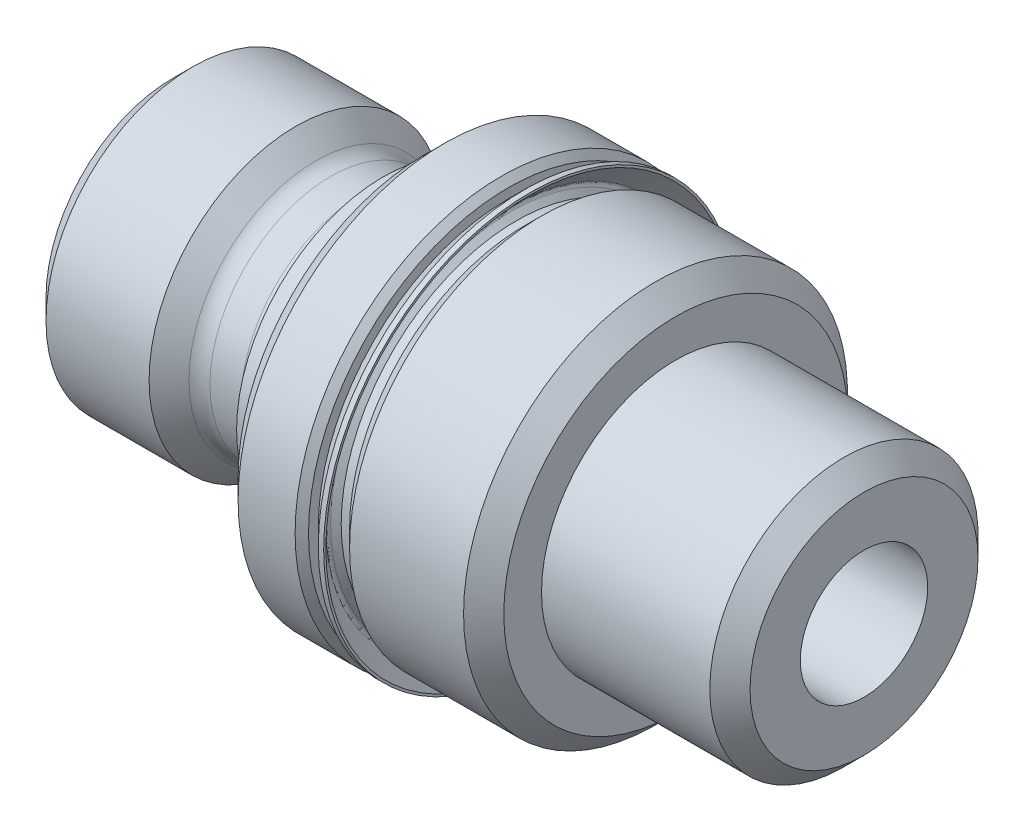
ISO-10303-21;
HEADER;
FILE_DESCRIPTION(('STEP AP214'),'2;1');
FILE_NAME('part.step','',(''),(''),'','','');
FILE_SCHEMA(('AUTOMOTIVE_DESIGN { 1 0 10303 214 1 1 1 1 }'));
ENDSEC;
DATA;
#1=APPLICATION_CONTEXT('core data for automotive mechanical design processes');
#2=APPLICATION_PROTOCOL_DEFINITION('international standard','automotive_design',2000,#1);
#3=PRODUCT_CONTEXT('',#1,'mechanical');
#4=PRODUCT('Part','Part','',(#3));
#5=PRODUCT_RELATED_PRODUCT_CATEGORY('part','',(#4));
#6=PRODUCT_DEFINITION_FORMATION('','',#4);
#7=PRODUCT_DEFINITION_CONTEXT('part definition',#1,'design');
#8=PRODUCT_DEFINITION('design','',#6,#7);
#9=PRODUCT_DEFINITION_SHAPE('','',#8);
#10=(LENGTH_UNIT() NAMED_UNIT(*) SI_UNIT(.MILLI.,.METRE.));
#11=(NAMED_UNIT(*) PLANE_ANGLE_UNIT() SI_UNIT($,.RADIAN.));
#12=(NAMED_UNIT(*) SI_UNIT($,.STERADIAN.) SOLID_ANGLE_UNIT());
#13=UNCERTAINTY_MEASURE_WITH_UNIT(LENGTH_MEASURE(1.E-05),#10,'distance_accuracy_value','');
#14=(GEOMETRIC_REPRESENTATION_CONTEXT(3) GLOBAL_UNCERTAINTY_ASSIGNED_CONTEXT((#13)) GLOBAL_UNIT_ASSIGNED_CONTEXT((#10,
#11,#12)) REPRESENTATION_CONTEXT('',''));
#15=CARTESIAN_POINT('',(0.,0.,0.));
#16=DIRECTION('',(0.,0.,1.));
#17=DIRECTION('',(1.,0.,0.));
#18=AXIS2_PLACEMENT_3D('',#15,#16,#17);
#19=CARTESIAN_POINT('',(12.7,7.5565,0.));
#20=DIRECTION('',(-1.,0.,0.));
#21=DIRECTION('',(0.,0.,1.));
#22=AXIS2_PLACEMENT_3D('',#19,#20,#21);
#23=PLANE('',#22);
#24=CARTESIAN_POINT('',(12.7,0.,0.));
#25=DIRECTION('',(-1.,0.,0.));
#26=DIRECTION('',(0.,0.,1.));
#27=AXIS2_PLACEMENT_3D('',#24,#25,#26);
#28=CIRCLE('',#27,7.5565);
#29=CARTESIAN_POINT('',(12.7,0.,7.5565));
#30=VERTEX_POINT('',#29);
#31=EDGE_CURVE('E87',#30,#30,#28,.T.);
#32=ORIENTED_EDGE('',*,*,#31,.F.);
#33=EDGE_LOOP('',(#32));
#34=FACE_BOUND('',#33,.T.);
#35=CARTESIAN_POINT('',(12.7,0.,0.));
#36=DIRECTION('',(-1.,0.,0.));
#37=DIRECTION('',(0.,0.,1.));
#38=AXIS2_PLACEMENT_3D('',#35,#36,#37);
#39=CIRCLE('',#38,7.1861438079811);
#40=CARTESIAN_POINT('',(12.7,0.,7.1861438079811));
#41=VERTEX_POINT('',#40);
#42=EDGE_CURVE('E10',#41,#41,#39,.F.);
#43=ORIENTED_EDGE('',*,*,#42,.F.);
#44=EDGE_LOOP('',(#43));
#45=FACE_BOUND('',#44,.T.);
#46=ADVANCED_FACE('F34',(#34,#45),#23,.F.);
#47=CARTESIAN_POINT('',(19.05,0.,0.));
#48=DIRECTION('',(-1.,0.,0.));
#49=DIRECTION('',(0.,0.,1.));
#50=AXIS2_PLACEMENT_3D('',#47,#48,#49);
#51=CYLINDRICAL_SURFACE('',#50,6.63575);
#52=CARTESIAN_POINT('',(13.335,0.,0.));
#53=DIRECTION('',(-1.,0.,0.));
#54=DIRECTION('',(0.,0.,1.));
#55=AXIS2_PLACEMENT_3D('',#52,#53,#54);
#56=CIRCLE('',#55,6.63575);
#57=CARTESIAN_POINT('',(13.335,0.,6.63575));
#58=VERTEX_POINT('',#57);
#59=EDGE_CURVE('E90',#58,#58,#56,.T.);
#60=ORIENTED_EDGE('',*,*,#59,.T.);
#61=EDGE_LOOP('',(#60));
#62=FACE_BOUND('',#61,.T.);
#63=CARTESIAN_POINT('',(13.0175,0.,0.));
#64=DIRECTION('',(-1.,0.,0.));
#65=DIRECTION('',(0.,0.,1.));
#66=AXIS2_PLACEMENT_3D('',#63,#64,#65);
#67=CIRCLE('',#66,6.63575);
#68=CARTESIAN_POINT('',(13.0175,0.,6.63575));
#69=VERTEX_POINT('',#68);
#70=EDGE_CURVE('E41',#69,#69,#67,.T.);
#71=ORIENTED_EDGE('',*,*,#70,.F.);
#72=EDGE_LOOP('',(#71));
#73=FACE_BOUND('',#72,.T.);
#74=ADVANCED_FACE('F145',(#62,#73),#51,.T.);
#75=CARTESIAN_POINT('',(19.05,6.50875,0.));
#76=DIRECTION('',(-1.,0.,0.));
#77=DIRECTION('',(0.,0.,1.));
#78=AXIS2_PLACEMENT_3D('',#75,#76,#77);
#79=PLANE('',#78);
#80=CARTESIAN_POINT('',(19.05,0.,0.));
#81=DIRECTION('',(-1.,0.,0.));
#82=DIRECTION('',(0.,0.,1.));
#83=AXIS2_PLACEMENT_3D('',#80,#81,#82);
#84=CIRCLE('',#83,6.50875);
#85=CARTESIAN_POINT('',(19.05,0.,6.50875));
#86=VERTEX_POINT('',#85);
#87=EDGE_CURVE('E99',#86,#86,#84,.T.);
#88=ORIENTED_EDGE('',*,*,#87,.F.);
#89=EDGE_LOOP('',(#88));
#90=FACE_BOUND('',#89,.T.);
#91=CARTESIAN_POINT('',(19.05,0.,0.));
#92=DIRECTION('',(-1.,0.,0.));
#93=DIRECTION('',(0.,0.,1.));
#94=AXIS2_PLACEMENT_3D('',#91,#92,#93);
#95=CIRCLE('',#94,5.08);
#96=CARTESIAN_POINT('',(19.05,0.,5.08));
#97=VERTEX_POINT('',#96);
#98=EDGE_CURVE('E45',#97,#97,#95,.F.);
#99=ORIENTED_EDGE('',*,*,#98,.F.);
#100=EDGE_LOOP('',(#99));
#101=FACE_BOUND('',#100,.T.);
#102=ADVANCED_FACE('F151',(#90,#101),#79,.F.);
#103=CARTESIAN_POINT('',(9.525,0.,0.));
#104=DIRECTION('',(-1.,0.,0.));
#105=DIRECTION('',(0.,0.,1.));
#106=AXIS2_PLACEMENT_3D('',#103,#104,#105);
#107=CYLINDRICAL_SURFACE('',#106,5.53085);
#108=CARTESIAN_POINT('',(7.9502,0.,0.));
#109=DIRECTION('',(-1.,0.,0.));
#110=DIRECTION('',(0.,0.,1.));
#111=AXIS2_PLACEMENT_3D('',#108,#109,#110);
#112=CIRCLE('',#111,5.53085);
#113=CARTESIAN_POINT('',(7.9502,0.,5.53085));
#114=VERTEX_POINT('',#113);
#115=EDGE_CURVE('E49',#114,#114,#112,.T.);
#116=ORIENTED_EDGE('',*,*,#115,.F.);
#117=EDGE_LOOP('',(#116));
#118=FACE_BOUND('',#117,.T.);
#119=CARTESIAN_POINT('',(9.525,0.,0.));
#120=DIRECTION('',(1.,0.,0.));
#121=DIRECTION('',(0.,0.,-1.));
#122=AXIS2_PLACEMENT_3D('',#119,#120,#121);
#123=CIRCLE('',#122,5.53085);
#124=CARTESIAN_POINT('',(9.525,0.,-5.53085));
#125=VERTEX_POINT('',#124);
#126=EDGE_CURVE('E75',#125,#125,#123,.T.);
#127=ORIENTED_EDGE('',*,*,#126,.F.);
#128=EDGE_LOOP('',(#127));
#129=FACE_BOUND('',#128,.T.);
#130=ADVANCED_FACE('F36',(#118,#129),#107,.T.);
#131=CARTESIAN_POINT('',(7.9502,5.37209999999985,0.));
#132=DIRECTION('',(1.,0.,0.));
#133=DIRECTION('',(0.,0.,-1.));
#134=AXIS2_PLACEMENT_3D('',#131,#132,#133);
#135=PLANE('',#134);
#136=CARTESIAN_POINT('',(7.9502,0.,0.));
#137=DIRECTION('',(-1.,0.,0.));
#138=DIRECTION('',(0.,0.,1.));
#139=AXIS2_PLACEMENT_3D('',#136,#137,#138);
#140=CIRCLE('',#139,5.37209999999985);
#141=CARTESIAN_POINT('',(7.9502,0.,5.37209999999985));
#142=VERTEX_POINT('',#141);
#143=EDGE_CURVE('E54',#142,#142,#140,.T.);
#144=ORIENTED_EDGE('',*,*,#143,.F.);
#145=EDGE_LOOP('',(#144));
#146=FACE_BOUND('',#145,.T.);
#147=ORIENTED_EDGE('',*,*,#115,.T.);
#148=EDGE_LOOP('',(#147));
#149=FACE_BOUND('',#148,.T.);
#150=ADVANCED_FACE('F201',(#146,#149),#135,.F.);
#151=CARTESIAN_POINT('',(7.15010000000015,0.,0.));
#152=DIRECTION('',(-1.,0.,0.));
#153=DIRECTION('',(0.,0.,1.));
#154=AXIS2_PLACEMENT_3D('',#151,#152,#153);
#155=TOROIDAL_SURFACE('',#154,5.37209999999985,0.800099999999851);
#156=CARTESIAN_POINT('',(7.15010000000015,0.,0.));
#157=DIRECTION('',(-1.,0.,0.));
#158=DIRECTION('',(0.,0.,1.));
#159=AXIS2_PLACEMENT_3D('',#156,#157,#158);
#160=CIRCLE('',#159,4.572);
#161=CARTESIAN_POINT('',(7.15010000000015,0.,4.572));
#162=VERTEX_POINT('',#161);
#163=EDGE_CURVE('E57',#162,#162,#160,.T.);
#164=ORIENTED_EDGE('',*,*,#163,.F.);
#165=EDGE_LOOP('',(#164));
#166=FACE_BOUND('',#165,.T.);
#167=ORIENTED_EDGE('',*,*,#143,.T.);
#168=EDGE_LOOP('',(#167));
#169=FACE_BOUND('',#168,.T.);
#170=ADVANCED_FACE('F198',(#166,#169),#155,.F.);
#171=CARTESIAN_POINT('',(9.525,0.,0.));
#172=DIRECTION('',(-1.,0.,0.));
#173=DIRECTION('',(0.,0.,1.));
#174=AXIS2_PLACEMENT_3D('',#171,#172,#173);
#175=CYLINDRICAL_SURFACE('',#174,4.572);
#176=CARTESIAN_POINT('',(5.9817,0.,0.));
#177=DIRECTION('',(-1.,0.,0.));
#178=DIRECTION('',(0.,0.,1.));
#179=AXIS2_PLACEMENT_3D('',#176,#177,#178);
#180=CIRCLE('',#179,4.572);
#181=CARTESIAN_POINT('',(5.9817,0.,4.572));
#182=VERTEX_POINT('',#181);
#183=EDGE_CURVE('E60',#182,#182,#180,.T.);
#184=ORIENTED_EDGE('',*,*,#183,.F.);
#185=EDGE_LOOP('',(#184));
#186=FACE_BOUND('',#185,.T.);
#187=ORIENTED_EDGE('',*,*,#163,.T.);
#188=EDGE_LOOP('',(#187));
#189=FACE_BOUND('',#188,.T.);
#190=ADVANCED_FACE('F194',(#186,#189),#175,.T.);
#191=CARTESIAN_POINT('',(5.98170000000007,0.,0.));
#192=DIRECTION('',(-1.,0.,0.));
#193=DIRECTION('',(0.,0.,1.));
#194=AXIS2_PLACEMENT_3D('',#191,#192,#193);
#195=TOROIDAL_SURFACE('',#194,5.37210000000021,0.800100000000214);
#196=CARTESIAN_POINT('',(5.41810329137171,0.,0.));
#197=DIRECTION('',(-1.,0.,0.));
#198=DIRECTION('',(0.,0.,1.));
#199=AXIS2_PLACEMENT_3D('',#196,#197,#198);
#200=CIRCLE('',#199,4.80419264838059);
#201=CARTESIAN_POINT('',(5.41810329137171,0.,4.80419264838059));
#202=VERTEX_POINT('',#201);
#203=EDGE_CURVE('E63',#202,#202,#200,.T.);
#204=ORIENTED_EDGE('',*,*,#203,.F.);
#205=EDGE_LOOP('',(#204));
#206=FACE_BOUND('',#205,.T.);
#207=ORIENTED_EDGE('',*,*,#183,.T.);
#208=EDGE_LOOP('',(#207));
#209=FACE_BOUND('',#208,.T.);
#210=ADVANCED_FACE('F190',(#206,#209),#195,.F.);
#211=CARTESIAN_POINT('',(5.41810329137171,0.,0.));
#212=DIRECTION('',(-1.,0.,0.));
#213=DIRECTION('',(0.,0.,1.));
#214=AXIS2_PLACEMENT_3D('',#211,#212,#213);
#215=CONICAL_SURFACE('',#214,4.80419264838059,0.781588524273102);
#216=CARTESIAN_POINT('',(4.6602938643726,0.,0.));
#217=DIRECTION('',(-1.,0.,0.));
#218=DIRECTION('',(0.,0.,1.));
#219=AXIS2_PLACEMENT_3D('',#216,#217,#218);
#220=CIRCLE('',#219,5.55625);
#221=CARTESIAN_POINT('',(4.6602938643726,0.,5.55625));
#222=VERTEX_POINT('',#221);
#223=EDGE_CURVE('E66',#222,#222,#220,.T.);
#224=ORIENTED_EDGE('',*,*,#223,.F.);
#225=EDGE_LOOP('',(#224));
#226=FACE_BOUND('',#225,.T.);
#227=ORIENTED_EDGE('',*,*,#203,.T.);
#228=EDGE_LOOP('',(#227));
#229=FACE_BOUND('',#228,.T.);
#230=ADVANCED_FACE('F186',(#226,#229),#215,.T.);
#231=CARTESIAN_POINT('',(9.525,0.,0.));
#232=DIRECTION('',(-1.,0.,0.));
#233=DIRECTION('',(0.,0.,1.));
#234=AXIS2_PLACEMENT_3D('',#231,#232,#233);
#235=CYLINDRICAL_SURFACE('',#234,5.55625);
#236=CARTESIAN_POINT('',(0.75565,0.,0.));
#237=DIRECTION('',(-1.,0.,0.));
#238=DIRECTION('',(0.,0.,1.));
#239=AXIS2_PLACEMENT_3D('',#236,#237,#238);
#240=CIRCLE('',#239,5.55625);
#241=CARTESIAN_POINT('',(0.75565,0.,5.55625));
#242=VERTEX_POINT('',#241);
#243=EDGE_CURVE('E69',#242,#242,#240,.T.);
#244=ORIENTED_EDGE('',*,*,#243,.F.);
#245=EDGE_LOOP('',(#244));
#246=FACE_BOUND('',#245,.T.);
#247=ORIENTED_EDGE('',*,*,#223,.T.);
#248=EDGE_LOOP('',(#247));
#249=FACE_BOUND('',#248,.T.);
#250=ADVANCED_FACE('F182',(#246,#249),#235,.T.);
#251=CARTESIAN_POINT('',(0.75565,0.,0.));
#252=DIRECTION('',(1.,0.,0.));
#253=DIRECTION('',(0.,0.,-1.));
#254=AXIS2_PLACEMENT_3D('',#251,#252,#253);
#255=CONICAL_SURFACE('',#254,5.55625,0.785398163397448);
#256=CARTESIAN_POINT('',(0.,0.,0.));
#257=DIRECTION('',(-1.,0.,0.));
#258=DIRECTION('',(0.,0.,1.));
#259=AXIS2_PLACEMENT_3D('',#256,#257,#258);
#260=CIRCLE('',#259,4.8006);
#261=CARTESIAN_POINT('',(0.,0.,4.8006));
#262=VERTEX_POINT('',#261);
#263=EDGE_CURVE('E72',#262,#262,#260,.T.);
#264=ORIENTED_EDGE('',*,*,#263,.F.);
#265=EDGE_LOOP('',(#264));
#266=FACE_BOUND('',#265,.T.);
#267=ORIENTED_EDGE('',*,*,#243,.T.);
#268=EDGE_LOOP('',(#267));
#269=FACE_BOUND('',#268,.T.);
#270=ADVANCED_FACE('F178',(#266,#269),#255,.T.);
#271=CARTESIAN_POINT('',(0.,0.,0.));
#272=DIRECTION('',(1.,0.,0.));
#273=DIRECTION('',(0.,0.,-1.));
#274=AXIS2_PLACEMENT_3D('',#271,#272,#273);
#275=PLANE('',#274);
#276=CARTESIAN_POINT('',(0.,0.,0.));
#277=DIRECTION('',(-1.,0.,0.));
#278=DIRECTION('',(0.,0.,1.));
#279=AXIS2_PLACEMENT_3D('',#276,#277,#278);
#280=CIRCLE('',#279,2.921);
#281=CARTESIAN_POINT('',(0.,0.,2.921));
#282=VERTEX_POINT('',#281);
#283=EDGE_CURVE('E114',#282,#282,#280,.T.);
#284=ORIENTED_EDGE('',*,*,#283,.F.);
#285=EDGE_LOOP('',(#284));
#286=FACE_BOUND('',#285,.T.);
#287=ORIENTED_EDGE('',*,*,#263,.T.);
#288=EDGE_LOOP('',(#287));
#289=FACE_BOUND('',#288,.T.);
#290=ADVANCED_FACE('F174',(#286,#289),#275,.F.);
#291=CARTESIAN_POINT('',(9.525,0.,0.));
#292=DIRECTION('',(1.,0.,0.));
#293=DIRECTION('',(0.,0.,-1.));
#294=AXIS2_PLACEMENT_3D('',#291,#292,#293);
#295=PLANE('',#294);
#296=CARTESIAN_POINT('',(9.525,0.,0.));
#297=DIRECTION('',(-1.,0.,0.));
#298=DIRECTION('',(0.,0.,1.));
#299=AXIS2_PLACEMENT_3D('',#296,#297,#298);
#300=CIRCLE('',#299,7.0485);
#301=CARTESIAN_POINT('',(9.525,0.,7.0485));
#302=VERTEX_POINT('',#301);
#303=EDGE_CURVE('E78',#302,#302,#300,.T.);
#304=ORIENTED_EDGE('',*,*,#303,.T.);
#305=EDGE_LOOP('',(#304));
#306=FACE_BOUND('',#305,.T.);
#307=ORIENTED_EDGE('',*,*,#126,.T.);
#308=EDGE_LOOP('',(#307));
#309=FACE_BOUND('',#308,.T.);
#310=ADVANCED_FACE('F170',(#306,#309),#295,.F.);
#311=CARTESIAN_POINT('',(10.287,0.,0.));
#312=DIRECTION('',(1.,0.,0.));
#313=DIRECTION('',(0.,0.,-1.));
#314=AXIS2_PLACEMENT_3D('',#311,#312,#313);
#315=CONICAL_SURFACE('',#314,7.8105,0.785398163397448);
#316=ORIENTED_EDGE('',*,*,#303,.F.);
#317=EDGE_LOOP('',(#316));
#318=FACE_BOUND('',#317,.T.);
#319=CARTESIAN_POINT('',(10.287,0.,0.));
#320=DIRECTION('',(-1.,0.,0.));
#321=DIRECTION('',(0.,0.,1.));
#322=AXIS2_PLACEMENT_3D('',#319,#320,#321);
#323=CIRCLE('',#322,7.8105);
#324=CARTESIAN_POINT('',(10.287,0.,7.8105));
#325=VERTEX_POINT('',#324);
#326=EDGE_CURVE('E81',#325,#325,#323,.T.);
#327=ORIENTED_EDGE('',*,*,#326,.T.);
#328=EDGE_LOOP('',(#327));
#329=FACE_BOUND('',#328,.T.);
#330=ADVANCED_FACE('F166',(#318,#329),#315,.T.);
#331=CARTESIAN_POINT('',(19.05,0.,0.));
#332=DIRECTION('',(-1.,0.,0.));
#333=DIRECTION('',(0.,0.,1.));
#334=AXIS2_PLACEMENT_3D('',#331,#332,#333);
#335=CYLINDRICAL_SURFACE('',#334,7.8105);
#336=ORIENTED_EDGE('',*,*,#326,.F.);
#337=EDGE_LOOP('',(#336));
#338=FACE_BOUND('',#337,.T.);
#339=CARTESIAN_POINT('',(12.446,0.,0.));
#340=DIRECTION('',(-1.,0.,0.));
#341=DIRECTION('',(0.,0.,1.));
#342=AXIS2_PLACEMENT_3D('',#339,#340,#341);
#343=CIRCLE('',#342,7.8105);
#344=CARTESIAN_POINT('',(12.446,0.,7.8105));
#345=VERTEX_POINT('',#344);
#346=EDGE_CURVE('E84',#345,#345,#343,.T.);
#347=ORIENTED_EDGE('',*,*,#346,.T.);
#348=EDGE_LOOP('',(#347));
#349=FACE_BOUND('',#348,.T.);
#350=ADVANCED_FACE('F162',(#338,#349),#335,.T.);
#351=CARTESIAN_POINT('',(12.7,0.,0.));
#352=DIRECTION('',(-1.,0.,0.));
#353=DIRECTION('',(0.,0.,1.));
#354=AXIS2_PLACEMENT_3D('',#351,#352,#353);
#355=CONICAL_SURFACE('',#354,7.5565,0.785398163397452);
#356=ORIENTED_EDGE('',*,*,#346,.F.);
#357=EDGE_LOOP('',(#356));
#358=FACE_BOUND('',#357,.T.);
#359=ORIENTED_EDGE('',*,*,#31,.T.);
#360=EDGE_LOOP('',(#359));
#361=FACE_BOUND('',#360,.T.);
#362=ADVANCED_FACE('F158',(#358,#361),#355,.T.);
#363=CARTESIAN_POINT('',(13.97,0.,0.));
#364=DIRECTION('',(1.,0.,0.));
#365=DIRECTION('',(0.,0.,-1.));
#366=AXIS2_PLACEMENT_3D('',#363,#364,#365);
#367=CONICAL_SURFACE('',#366,7.27075,0.785398163397448);
#368=ORIENTED_EDGE('',*,*,#59,.F.);
#369=EDGE_LOOP('',(#368));
#370=FACE_BOUND('',#369,.T.);
#371=CARTESIAN_POINT('',(13.97,0.,0.));
#372=DIRECTION('',(-1.,0.,0.));
#373=DIRECTION('',(0.,0.,1.));
#374=AXIS2_PLACEMENT_3D('',#371,#372,#373);
#375=CIRCLE('',#374,7.27075);
#376=CARTESIAN_POINT('',(13.97,0.,7.27075));
#377=VERTEX_POINT('',#376);
#378=EDGE_CURVE('E93',#377,#377,#375,.T.);
#379=ORIENTED_EDGE('',*,*,#378,.T.);
#380=EDGE_LOOP('',(#379));
#381=FACE_BOUND('',#380,.T.);
#382=ADVANCED_FACE('F161',(#370,#381),#367,.T.);
#383=CARTESIAN_POINT('',(19.05,0.,0.));
#384=DIRECTION('',(-1.,0.,0.));
#385=DIRECTION('',(0.,0.,1.));
#386=AXIS2_PLACEMENT_3D('',#383,#384,#385);
#387=CYLINDRICAL_SURFACE('',#386,7.27075);
#388=ORIENTED_EDGE('',*,*,#378,.F.);
#389=EDGE_LOOP('',(#388));
#390=FACE_BOUND('',#389,.T.);
#391=CARTESIAN_POINT('',(18.288,0.,0.));
#392=DIRECTION('',(-1.,0.,0.));
#393=DIRECTION('',(0.,0.,1.));
#394=AXIS2_PLACEMENT_3D('',#391,#392,#393);
#395=CIRCLE('',#394,7.27075);
#396=CARTESIAN_POINT('',(18.288,0.,7.27075));
#397=VERTEX_POINT('',#396);
#398=EDGE_CURVE('E96',#397,#397,#395,.T.);
#399=ORIENTED_EDGE('',*,*,#398,.T.);
#400=EDGE_LOOP('',(#399));
#401=FACE_BOUND('',#400,.T.);
#402=ADVANCED_FACE('F232',(#390,#401),#387,.T.);
#403=CARTESIAN_POINT('',(19.05,0.,0.));
#404=DIRECTION('',(-1.,0.,0.));
#405=DIRECTION('',(0.,0.,1.));
#406=AXIS2_PLACEMENT_3D('',#403,#404,#405);
#407=CONICAL_SURFACE('',#406,6.50875,0.785398163397449);
#408=ORIENTED_EDGE('',*,*,#398,.F.);
#409=EDGE_LOOP('',(#408));
#410=FACE_BOUND('',#409,.T.);
#411=ORIENTED_EDGE('',*,*,#87,.T.);
#412=EDGE_LOOP('',(#411));
#413=FACE_BOUND('',#412,.T.);
#414=ADVANCED_FACE('F229',(#410,#413),#407,.T.);
#415=CARTESIAN_POINT('',(26.1874,0.,0.));
#416=DIRECTION('',(-1.,0.,0.));
#417=DIRECTION('',(0.,0.,1.));
#418=AXIS2_PLACEMENT_3D('',#415,#416,#417);
#419=CYLINDRICAL_SURFACE('',#418,5.08);
#420=ORIENTED_EDGE('',*,*,#98,.T.);
#421=EDGE_LOOP('',(#420));
#422=FACE_BOUND('',#421,.T.);
#423=CARTESIAN_POINT('',(25.4254,0.,0.));
#424=DIRECTION('',(-1.,0.,0.));
#425=DIRECTION('',(0.,0.,1.));
#426=AXIS2_PLACEMENT_3D('',#423,#424,#425);
#427=CIRCLE('',#426,5.08);
#428=CARTESIAN_POINT('',(25.4254,0.,5.08));
#429=VERTEX_POINT('',#428);
#430=EDGE_CURVE('E102',#429,#429,#427,.T.);
#431=ORIENTED_EDGE('',*,*,#430,.T.);
#432=EDGE_LOOP('',(#431));
#433=FACE_BOUND('',#432,.T.);
#434=ADVANCED_FACE('F227',(#422,#433),#419,.T.);
#435=CARTESIAN_POINT('',(26.1874,0.,0.));
#436=DIRECTION('',(-1.,0.,0.));
#437=DIRECTION('',(0.,0.,1.));
#438=AXIS2_PLACEMENT_3D('',#435,#436,#437);
#439=CONICAL_SURFACE('',#438,4.318,0.78539816339745);
#440=ORIENTED_EDGE('',*,*,#430,.F.);
#441=EDGE_LOOP('',(#440));
#442=FACE_BOUND('',#441,.T.);
#443=CARTESIAN_POINT('',(26.1874,0.,0.));
#444=DIRECTION('',(-1.,0.,0.));
#445=DIRECTION('',(0.,0.,1.));
#446=AXIS2_PLACEMENT_3D('',#443,#444,#445);
#447=CIRCLE('',#446,4.318);
#448=CARTESIAN_POINT('',(26.1874,0.,4.318));
#449=VERTEX_POINT('',#448);
#450=EDGE_CURVE('E105',#449,#449,#447,.T.);
#451=ORIENTED_EDGE('',*,*,#450,.T.);
#452=EDGE_LOOP('',(#451));
#453=FACE_BOUND('',#452,.T.);
#454=ADVANCED_FACE('F266',(#442,#453),#439,.T.);
#455=CARTESIAN_POINT('',(26.1874,4.318,0.));
#456=DIRECTION('',(-1.,0.,0.));
#457=DIRECTION('',(0.,0.,1.));
#458=AXIS2_PLACEMENT_3D('',#455,#456,#457);
#459=PLANE('',#458);
#460=CARTESIAN_POINT('',(26.1874,0.,0.));
#461=DIRECTION('',(-1.,0.,0.));
#462=DIRECTION('',(0.,0.,1.));
#463=AXIS2_PLACEMENT_3D('',#460,#461,#462);
#464=CIRCLE('',#463,2.413);
#465=CARTESIAN_POINT('',(26.1874,0.,2.413));
#466=VERTEX_POINT('',#465);
#467=EDGE_CURVE('E108',#466,#466,#464,.T.);
#468=ORIENTED_EDGE('',*,*,#467,.T.);
#469=EDGE_LOOP('',(#468));
#470=FACE_BOUND('',#469,.T.);
#471=ORIENTED_EDGE('',*,*,#450,.F.);
#472=EDGE_LOOP('',(#471));
#473=FACE_BOUND('',#472,.T.);
#474=ADVANCED_FACE('F274',(#470,#473),#459,.F.);
#475=CARTESIAN_POINT('',(0.,0.,0.));
#476=DIRECTION('',(-1.,0.,0.));
#477=DIRECTION('',(0.,0.,1.));
#478=AXIS2_PLACEMENT_3D('',#475,#476,#477);
#479=CYLINDRICAL_SURFACE('',#478,2.413);
#480=ORIENTED_EDGE('',*,*,#467,.F.);
#481=EDGE_LOOP('',(#480));
#482=FACE_BOUND('',#481,.T.);
#483=CARTESIAN_POINT('',(0.507999999999995,0.,0.));
#484=DIRECTION('',(-1.,0.,0.));
#485=DIRECTION('',(0.,0.,1.));
#486=AXIS2_PLACEMENT_3D('',#483,#484,#485);
#487=CIRCLE('',#486,2.413);
#488=CARTESIAN_POINT('',(0.507999999999995,0.,2.413));
#489=VERTEX_POINT('',#488);
#490=EDGE_CURVE('E111',#489,#489,#487,.T.);
#491=ORIENTED_EDGE('',*,*,#490,.T.);
#492=EDGE_LOOP('',(#491));
#493=FACE_BOUND('',#492,.T.);
#494=ADVANCED_FACE('F281',(#482,#493),#479,.F.);
#495=CARTESIAN_POINT('',(0.,0.,0.));
#496=DIRECTION('',(-1.,0.,0.));
#497=DIRECTION('',(0.,0.,1.));
#498=AXIS2_PLACEMENT_3D('',#495,#496,#497);
#499=CONICAL_SURFACE('',#498,2.921,0.785398163397448);
#500=ORIENTED_EDGE('',*,*,#490,.F.);
#501=EDGE_LOOP('',(#500));
#502=FACE_BOUND('',#501,.T.);
#503=ORIENTED_EDGE('',*,*,#283,.T.);
#504=EDGE_LOOP('',(#503));
#505=FACE_BOUND('',#504,.T.);
#506=ADVANCED_FACE('F290',(#502,#505),#499,.F.);
#507=CARTESIAN_POINT('',(13.324356192019,0.,0.));
#508=DIRECTION('',(1.,0.,0.));
#509=DIRECTION('',(0.,0.,-1.));
#510=AXIS2_PLACEMENT_3D('',#507,#508,#509);
#511=CONICAL_SURFACE('',#510,7.8105,0.785398163397368);
#512=ORIENTED_EDGE('',*,*,#42,.T.);
#513=EDGE_LOOP('',(#512));
#514=FACE_BOUND('',#513,.T.);
#515=CARTESIAN_POINT('',(13.324356192019,0.,0.));
#516=DIRECTION('',(-1.,0.,0.));
#517=DIRECTION('',(0.,0.,1.));
#518=AXIS2_PLACEMENT_3D('',#515,#516,#517);
#519=CIRCLE('',#518,7.8105);
#520=CARTESIAN_POINT('',(13.324356192019,0.,7.8105));
#521=VERTEX_POINT('',#520);
#522=EDGE_CURVE('E117',#521,#521,#519,.T.);
#523=ORIENTED_EDGE('',*,*,#522,.T.);
#524=EDGE_LOOP('',(#523));
#525=FACE_BOUND('',#524,.T.);
#526=ADVANCED_FACE('F298',(#514,#525),#511,.T.);
#527=CARTESIAN_POINT('',(13.335,0.,0.));
#528=DIRECTION('',(-1.,0.,0.));
#529=DIRECTION('',(0.,0.,1.));
#530=AXIS2_PLACEMENT_3D('',#527,#528,#529);
#531=CYLINDRICAL_SURFACE('',#530,7.81050000000003);
#532=ORIENTED_EDGE('',*,*,#522,.F.);
#533=EDGE_LOOP('',(#532));
#534=FACE_BOUND('',#533,.T.);
#535=CARTESIAN_POINT('',(13.5275561920188,0.,0.));
#536=DIRECTION('',(-1.,0.,0.));
#537=DIRECTION('',(0.,0.,1.));
#538=AXIS2_PLACEMENT_3D('',#535,#536,#537);
#539=CIRCLE('',#538,7.81050000000005);
#540=CARTESIAN_POINT('',(13.5275561920188,0.,7.81050000000005));
#541=VERTEX_POINT('',#540);
#542=EDGE_CURVE('E120',#541,#541,#539,.T.);
#543=ORIENTED_EDGE('',*,*,#542,.T.);
#544=EDGE_LOOP('',(#543));
#545=FACE_BOUND('',#544,.T.);
#546=ADVANCED_FACE('F307',(#534,#545),#531,.T.);
#547=CARTESIAN_POINT('',(13.5275561920188,7.72633180412595,0.));
#548=DIRECTION('',(-1.,0.,0.));
#549=DIRECTION('',(0.,0.,1.));
#550=AXIS2_PLACEMENT_3D('',#547,#548,#549);
#551=PLANE('',#550);
#552=ORIENTED_EDGE('',*,*,#542,.F.);
#553=EDGE_LOOP('',(#552));
#554=FACE_BOUND('',#553,.T.);
#555=CARTESIAN_POINT('',(13.5275561920188,0.,0.));
#556=DIRECTION('',(-1.,0.,0.));
#557=DIRECTION('',(0.,0.,1.));
#558=AXIS2_PLACEMENT_3D('',#555,#556,#557);
#559=CIRCLE('',#558,7.72633180412595);
#560=CARTESIAN_POINT('',(13.5275561920188,0.,7.72633180412595));
#561=VERTEX_POINT('',#560);
#562=EDGE_CURVE('E123',#561,#561,#559,.T.);
#563=ORIENTED_EDGE('',*,*,#562,.T.);
#564=EDGE_LOOP('',(#563));
#565=FACE_BOUND('',#564,.T.);
#566=ADVANCED_FACE('F315',(#554,#565),#551,.F.);
#567=CARTESIAN_POINT('',(12.8170397551577,0.,0.));
#568=DIRECTION('',(1.,0.,0.));
#569=DIRECTION('',(0.,0.,-1.));
#570=AXIS2_PLACEMENT_3D('',#567,#568,#569);
#571=CONICAL_SURFACE('',#570,7.01581536726465,0.78539816339752);
#572=ORIENTED_EDGE('',*,*,#562,.F.);
#573=EDGE_LOOP('',(#572));
#574=FACE_BOUND('',#573,.T.);
#575=CARTESIAN_POINT('',(12.8170397551577,0.,0.));
#576=DIRECTION('',(-1.,0.,0.));
#577=DIRECTION('',(0.,0.,1.));
#578=AXIS2_PLACEMENT_3D('',#575,#576,#577);
#579=CIRCLE('',#578,7.01581536726465);
#580=CARTESIAN_POINT('',(12.8170397551577,0.,7.01581536726465));
#581=VERTEX_POINT('',#580);
#582=EDGE_CURVE('E126',#581,#581,#579,.T.);
#583=ORIENTED_EDGE('',*,*,#582,.T.);
#584=EDGE_LOOP('',(#583));
#585=FACE_BOUND('',#584,.T.);
#586=ADVANCED_FACE('F141',(#574,#585),#571,.F.);
#587=CARTESIAN_POINT('',(12.9068423163686,0.,0.));
#588=DIRECTION('',(-1.,0.,0.));
#589=DIRECTION('',(0.,0.,1.));
#590=AXIS2_PLACEMENT_3D('',#587,#588,#589);
#591=TOROIDAL_SURFACE('',#590,6.92601280605345,0.127000000000576);
#592=ORIENTED_EDGE('',*,*,#582,.F.);
#593=EDGE_LOOP('',(#592));
#594=FACE_BOUND('',#593,.T.);
#595=CARTESIAN_POINT('',(12.8170397551576,0.,0.));
#596=DIRECTION('',(-1.,0.,0.));
#597=DIRECTION('',(0.,0.,1.));
#598=AXIS2_PLACEMENT_3D('',#595,#596,#597);
#599=CIRCLE('',#598,6.8362102448424);
#600=CARTESIAN_POINT('',(12.8170397551576,0.,6.8362102448424));
#601=VERTEX_POINT('',#600);
#602=EDGE_CURVE('E129',#601,#601,#599,.T.);
#603=ORIENTED_EDGE('',*,*,#602,.T.);
#604=EDGE_LOOP('',(#603));
#605=FACE_BOUND('',#604,.T.);
#606=ADVANCED_FACE('F133',(#594,#605),#591,.F.);
#607=CARTESIAN_POINT('',(13.0175,0.,0.));
#608=DIRECTION('',(-1.,0.,0.));
#609=DIRECTION('',(0.,0.,1.));
#610=AXIS2_PLACEMENT_3D('',#607,#608,#609);
#611=CONICAL_SURFACE('',#610,6.63575,0.78539816339745);
#612=ORIENTED_EDGE('',*,*,#602,.F.);
#613=EDGE_LOOP('',(#612));
#614=FACE_BOUND('',#613,.T.);
#615=ORIENTED_EDGE('',*,*,#70,.T.);
#616=EDGE_LOOP('',(#615));
#617=FACE_BOUND('',#616,.T.);
#618=ADVANCED_FACE('F135',(#614,#617),#611,.T.);
#619=CLOSED_SHELL('',(#46,#74,#102,#130,#150,#170,#190,#210,#230,#250,#270,#290,#310,#330,#350,
#362,#382,#402,#414,#434,#454,#474,#494,#506,#526,#546,#566,#586,#606,#618));
#620=MANIFOLD_SOLID_BREP('B2',#619);
#621=ADVANCED_BREP_SHAPE_REPRESENTATION('',(#18,#620),#14);
#622=SHAPE_DEFINITION_REPRESENTATION(#9,#621);
ENDSEC;
END-ISO-10303-21;
